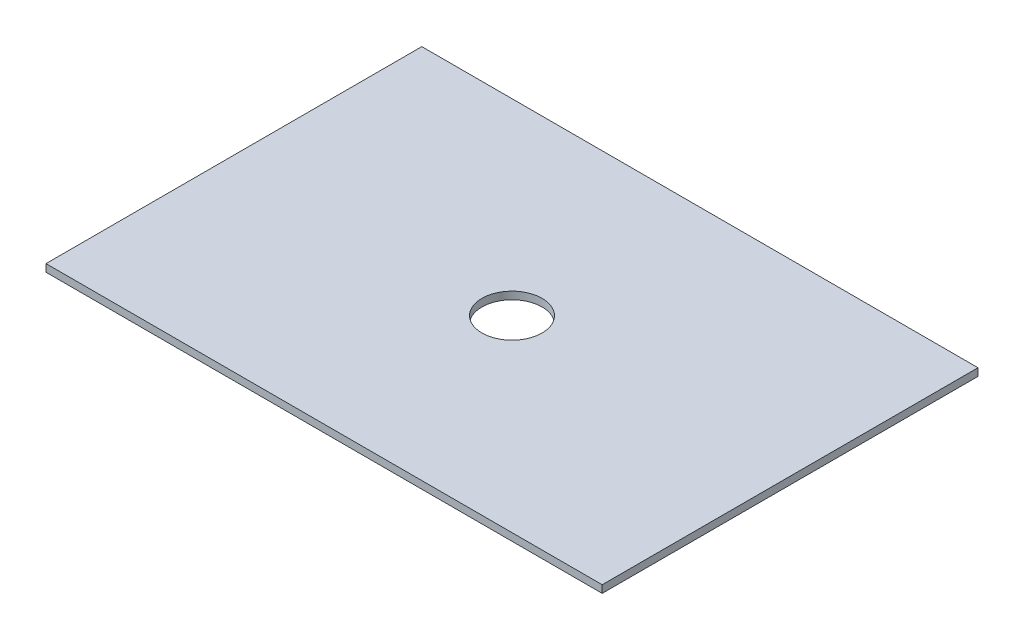
ISO-10303-21;
HEADER;
FILE_DESCRIPTION(('STEP AP214'),'2;1');
FILE_NAME('part.step','',(''),(''),'','','');
FILE_SCHEMA(('AUTOMOTIVE_DESIGN { 1 0 10303 214 1 1 1 1 }'));
ENDSEC;
DATA;
#1=APPLICATION_CONTEXT('core data for automotive mechanical design processes');
#2=APPLICATION_PROTOCOL_DEFINITION('international standard','automotive_design',2000,#1);
#3=PRODUCT_CONTEXT('',#1,'mechanical');
#4=PRODUCT('Part','Part','',(#3));
#5=PRODUCT_RELATED_PRODUCT_CATEGORY('part','',(#4));
#6=PRODUCT_DEFINITION_FORMATION('','',#4);
#7=PRODUCT_DEFINITION_CONTEXT('part definition',#1,'design');
#8=PRODUCT_DEFINITION('design','',#6,#7);
#9=PRODUCT_DEFINITION_SHAPE('','',#8);
#10=(LENGTH_UNIT() NAMED_UNIT(*) SI_UNIT(.MILLI.,.METRE.));
#11=(NAMED_UNIT(*) PLANE_ANGLE_UNIT() SI_UNIT($,.RADIAN.));
#12=(NAMED_UNIT(*) SI_UNIT($,.STERADIAN.) SOLID_ANGLE_UNIT());
#13=UNCERTAINTY_MEASURE_WITH_UNIT(LENGTH_MEASURE(1.E-05),#10,'distance_accuracy_value','');
#14=(GEOMETRIC_REPRESENTATION_CONTEXT(3) GLOBAL_UNCERTAINTY_ASSIGNED_CONTEXT((#13)) GLOBAL_UNIT_ASSIGNED_CONTEXT((#10,
#11,#12)) REPRESENTATION_CONTEXT('',''));
#15=CARTESIAN_POINT('',(0.,0.,0.));
#16=DIRECTION('',(0.,0.,1.));
#17=DIRECTION('',(1.,0.,0.));
#18=AXIS2_PLACEMENT_3D('',#15,#16,#17);
#19=CARTESIAN_POINT('',(0.,6.35,0.));
#20=DIRECTION('',(0.,-1.,0.));
#21=DIRECTION('',(0.,0.,-1.));
#22=AXIS2_PLACEMENT_3D('',#19,#20,#21);
#23=PLANE('',#22);
#24=DIRECTION('',(0.,0.,1.));
#25=VECTOR('',#24,1.);
#26=CARTESIAN_POINT('',(0.,6.35,0.));
#27=LINE('',#26,#25);
#28=CARTESIAN_POINT('',(0.,6.35,-317.5));
#29=VERTEX_POINT('',#28);
#30=CARTESIAN_POINT('',(0.,6.35,0.));
#31=VERTEX_POINT('',#30);
#32=EDGE_CURVE('E96',#29,#31,#27,.T.);
#33=ORIENTED_EDGE('',*,*,#32,.T.);
#34=DIRECTION('',(1.,0.,0.));
#35=VECTOR('',#34,1.);
#36=CARTESIAN_POINT('',(0.,6.35,0.));
#37=LINE('',#36,#35);
#38=CARTESIAN_POINT('',(469.9,6.35,0.));
#39=VERTEX_POINT('',#38);
#40=EDGE_CURVE('E91',#31,#39,#37,.T.);
#41=ORIENTED_EDGE('',*,*,#40,.T.);
#42=DIRECTION('',(0.,0.,-1.));
#43=VECTOR('',#42,1.);
#44=CARTESIAN_POINT('',(469.9,6.35,0.));
#45=LINE('',#44,#43);
#46=CARTESIAN_POINT('',(469.9,6.35,-317.5));
#47=VERTEX_POINT('',#46);
#48=EDGE_CURVE('E94',#39,#47,#45,.T.);
#49=ORIENTED_EDGE('',*,*,#48,.T.);
#50=DIRECTION('',(-1.,0.,0.));
#51=VECTOR('',#50,1.);
#52=CARTESIAN_POINT('',(0.,6.35,-317.5));
#53=LINE('',#52,#51);
#54=EDGE_CURVE('E61',#47,#29,#53,.T.);
#55=ORIENTED_EDGE('',*,*,#54,.T.);
#56=EDGE_LOOP('',(#33,#41,#49,#55));
#57=FACE_BOUND('',#56,.T.);
#58=CARTESIAN_POINT('',(234.95,6.35,-158.75));
#59=DIRECTION('',(0.,1.,0.));
#60=DIRECTION('',(0.,0.,1.));
#61=AXIS2_PLACEMENT_3D('',#58,#59,#60);
#62=CIRCLE('',#61,25.4);
#63=CARTESIAN_POINT('',(234.95,6.35,-133.35));
#64=VERTEX_POINT('',#63);
#65=EDGE_CURVE('E116',#64,#64,#62,.T.);
#66=ORIENTED_EDGE('',*,*,#65,.F.);
#67=EDGE_LOOP('',(#66));
#68=FACE_BOUND('',#67,.T.);
#69=ADVANCED_FACE('F43',(#57,#68),#23,.F.);
#70=CARTESIAN_POINT('',(0.,0.,0.));
#71=DIRECTION('',(0.,-1.,0.));
#72=DIRECTION('',(0.,0.,-1.));
#73=AXIS2_PLACEMENT_3D('',#70,#71,#72);
#74=PLANE('',#73);
#75=DIRECTION('',(0.,0.,1.));
#76=VECTOR('',#75,1.);
#77=CARTESIAN_POINT('',(0.,0.,0.));
#78=LINE('',#77,#76);
#79=CARTESIAN_POINT('',(0.,0.,-317.5));
#80=VERTEX_POINT('',#79);
#81=CARTESIAN_POINT('',(0.,0.,0.));
#82=VERTEX_POINT('',#81);
#83=EDGE_CURVE('E112',#80,#82,#78,.T.);
#84=ORIENTED_EDGE('',*,*,#83,.F.);
#85=DIRECTION('',(-1.,0.,0.));
#86=VECTOR('',#85,1.);
#87=CARTESIAN_POINT('',(0.,0.,-317.5));
#88=LINE('',#87,#86);
#89=CARTESIAN_POINT('',(469.9,0.,-317.5));
#90=VERTEX_POINT('',#89);
#91=EDGE_CURVE('E84',#90,#80,#88,.T.);
#92=ORIENTED_EDGE('',*,*,#91,.F.);
#93=DIRECTION('',(0.,0.,-1.));
#94=VECTOR('',#93,1.);
#95=CARTESIAN_POINT('',(469.9,0.,0.));
#96=LINE('',#95,#94);
#97=CARTESIAN_POINT('',(469.9,0.,0.));
#98=VERTEX_POINT('',#97);
#99=EDGE_CURVE('E78',#98,#90,#96,.T.);
#100=ORIENTED_EDGE('',*,*,#99,.F.);
#101=DIRECTION('',(1.,0.,0.));
#102=VECTOR('',#101,1.);
#103=CARTESIAN_POINT('',(0.,0.,0.));
#104=LINE('',#103,#102);
#105=EDGE_CURVE('E101',#82,#98,#104,.T.);
#106=ORIENTED_EDGE('',*,*,#105,.F.);
#107=EDGE_LOOP('',(#84,#92,#100,#106));
#108=FACE_BOUND('',#107,.T.);
#109=CARTESIAN_POINT('',(234.95,0.,-158.75));
#110=DIRECTION('',(0.,1.,0.));
#111=DIRECTION('',(0.,0.,1.));
#112=AXIS2_PLACEMENT_3D('',#109,#110,#111);
#113=CIRCLE('',#112,25.4);
#114=CARTESIAN_POINT('',(234.95,0.,-133.35));
#115=VERTEX_POINT('',#114);
#116=EDGE_CURVE('E134',#115,#115,#113,.T.);
#117=ORIENTED_EDGE('',*,*,#116,.T.);
#118=EDGE_LOOP('',(#117));
#119=FACE_BOUND('',#118,.T.);
#120=ADVANCED_FACE('F129',(#108,#119),#74,.T.);
#121=CARTESIAN_POINT('',(0.,6.35,0.));
#122=DIRECTION('',(1.,0.,0.));
#123=DIRECTION('',(0.,0.,-1.));
#124=AXIS2_PLACEMENT_3D('',#121,#122,#123);
#125=PLANE('',#124);
#126=ORIENTED_EDGE('',*,*,#83,.T.);
#127=DIRECTION('',(0.,-1.,0.));
#128=VECTOR('',#127,1.);
#129=CARTESIAN_POINT('',(0.,6.35,0.));
#130=LINE('',#129,#128);
#131=EDGE_CURVE('E11',#31,#82,#130,.T.);
#132=ORIENTED_EDGE('',*,*,#131,.F.);
#133=ORIENTED_EDGE('',*,*,#32,.F.);
#134=DIRECTION('',(0.,-1.,0.));
#135=VECTOR('',#134,1.);
#136=CARTESIAN_POINT('',(0.,6.35,-317.5));
#137=LINE('',#136,#135);
#138=EDGE_CURVE('E108',#29,#80,#137,.T.);
#139=ORIENTED_EDGE('',*,*,#138,.T.);
#140=EDGE_LOOP('',(#126,#132,#133,#139));
#141=FACE_BOUND('',#140,.T.);
#142=ADVANCED_FACE('F45',(#141),#125,.F.);
#143=CARTESIAN_POINT('',(0.,6.35,0.));
#144=DIRECTION('',(0.,0.,-1.));
#145=DIRECTION('',(-1.,0.,0.));
#146=AXIS2_PLACEMENT_3D('',#143,#144,#145);
#147=PLANE('',#146);
#148=ORIENTED_EDGE('',*,*,#105,.T.);
#149=DIRECTION('',(0.,-1.,0.));
#150=VECTOR('',#149,1.);
#151=CARTESIAN_POINT('',(469.9,6.35,0.));
#152=LINE('',#151,#150);
#153=EDGE_CURVE('E53',#39,#98,#152,.T.);
#154=ORIENTED_EDGE('',*,*,#153,.F.);
#155=ORIENTED_EDGE('',*,*,#40,.F.);
#156=ORIENTED_EDGE('',*,*,#131,.T.);
#157=EDGE_LOOP('',(#148,#154,#155,#156));
#158=FACE_BOUND('',#157,.T.);
#159=ADVANCED_FACE('F100',(#158),#147,.F.);
#160=CARTESIAN_POINT('',(469.9,6.35,0.));
#161=DIRECTION('',(-1.,0.,0.));
#162=DIRECTION('',(0.,0.,1.));
#163=AXIS2_PLACEMENT_3D('',#160,#161,#162);
#164=PLANE('',#163);
#165=ORIENTED_EDGE('',*,*,#99,.T.);
#166=DIRECTION('',(0.,-1.,0.));
#167=VECTOR('',#166,1.);
#168=CARTESIAN_POINT('',(469.9,6.35,-317.5));
#169=LINE('',#168,#167);
#170=EDGE_CURVE('E103',#47,#90,#169,.T.);
#171=ORIENTED_EDGE('',*,*,#170,.F.);
#172=ORIENTED_EDGE('',*,*,#48,.F.);
#173=ORIENTED_EDGE('',*,*,#153,.T.);
#174=EDGE_LOOP('',(#165,#171,#172,#173));
#175=FACE_BOUND('',#174,.T.);
#176=ADVANCED_FACE('F104',(#175),#164,.F.);
#177=CARTESIAN_POINT('',(0.,6.35,-317.5));
#178=DIRECTION('',(0.,0.,1.));
#179=DIRECTION('',(1.,0.,0.));
#180=AXIS2_PLACEMENT_3D('',#177,#178,#179);
#181=PLANE('',#180);
#182=ORIENTED_EDGE('',*,*,#91,.T.);
#183=ORIENTED_EDGE('',*,*,#138,.F.);
#184=ORIENTED_EDGE('',*,*,#54,.F.);
#185=ORIENTED_EDGE('',*,*,#170,.T.);
#186=EDGE_LOOP('',(#182,#183,#184,#185));
#187=FACE_BOUND('',#186,.T.);
#188=ADVANCED_FACE('F126',(#187),#181,.F.);
#189=CARTESIAN_POINT('',(234.95,6.35,-158.75));
#190=DIRECTION('',(0.,-1.,0.));
#191=DIRECTION('',(0.,0.,-1.));
#192=AXIS2_PLACEMENT_3D('',#189,#190,#191);
#193=CYLINDRICAL_SURFACE('',#192,25.4);
#194=ORIENTED_EDGE('',*,*,#65,.T.);
#195=EDGE_LOOP('',(#194));
#196=FACE_BOUND('',#195,.T.);
#197=ORIENTED_EDGE('',*,*,#116,.F.);
#198=EDGE_LOOP('',(#197));
#199=FACE_BOUND('',#198,.T.);
#200=ADVANCED_FACE('F142',(#196,#199),#193,.F.);
#201=CLOSED_SHELL('',(#69,#120,#142,#159,#176,#188,#200));
#202=MANIFOLD_SOLID_BREP('B2',#201);
#203=ADVANCED_BREP_SHAPE_REPRESENTATION('',(#18,#202),#14);
#204=SHAPE_DEFINITION_REPRESENTATION(#9,#203);
ENDSEC;
END-ISO-10303-21;
